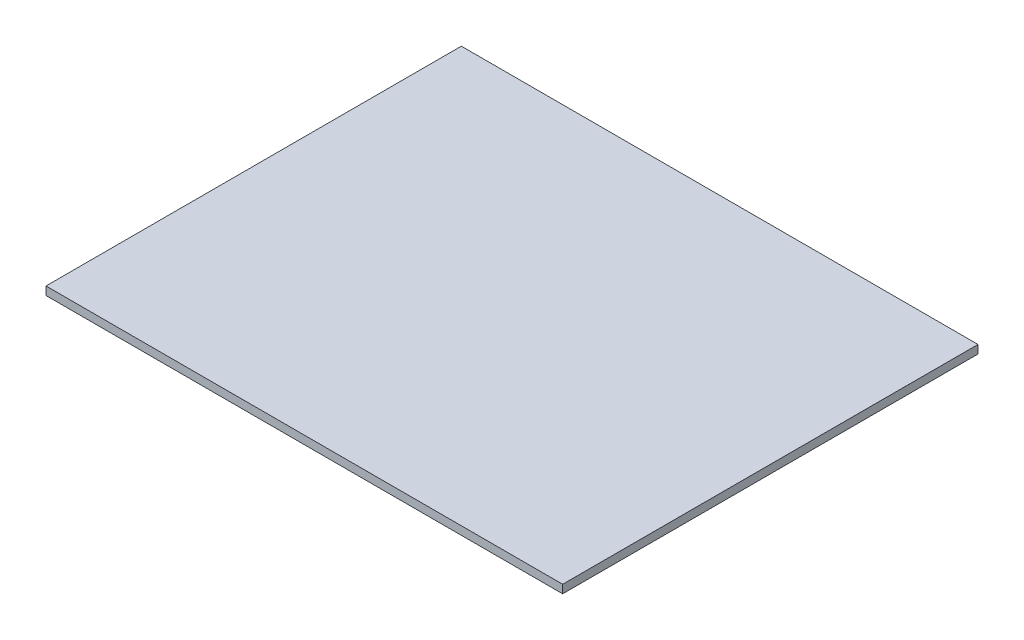
ISO-10303-21;
HEADER;
FILE_DESCRIPTION(('STEP AP214'),'2;1');
FILE_NAME('part.step','',(''),(''),'','','');
FILE_SCHEMA(('AUTOMOTIVE_DESIGN { 1 0 10303 214 1 1 1 1 }'));
ENDSEC;
DATA;
#1=APPLICATION_CONTEXT('core data for automotive mechanical design processes');
#2=APPLICATION_PROTOCOL_DEFINITION('international standard','automotive_design',2000,#1);
#3=PRODUCT_CONTEXT('',#1,'mechanical');
#4=PRODUCT('Part','Part','',(#3));
#5=PRODUCT_RELATED_PRODUCT_CATEGORY('part','',(#4));
#6=PRODUCT_DEFINITION_FORMATION('','',#4);
#7=PRODUCT_DEFINITION_CONTEXT('part definition',#1,'design');
#8=PRODUCT_DEFINITION('design','',#6,#7);
#9=PRODUCT_DEFINITION_SHAPE('','',#8);
#10=(LENGTH_UNIT() NAMED_UNIT(*) SI_UNIT(.MILLI.,.METRE.));
#11=(NAMED_UNIT(*) PLANE_ANGLE_UNIT() SI_UNIT($,.RADIAN.));
#12=(NAMED_UNIT(*) SI_UNIT($,.STERADIAN.) SOLID_ANGLE_UNIT());
#13=UNCERTAINTY_MEASURE_WITH_UNIT(LENGTH_MEASURE(1.E-05),#10,'distance_accuracy_value','');
#14=(GEOMETRIC_REPRESENTATION_CONTEXT(3) GLOBAL_UNCERTAINTY_ASSIGNED_CONTEXT((#13)) GLOBAL_UNIT_ASSIGNED_CONTEXT((#10,
#11,#12)) REPRESENTATION_CONTEXT('',''));
#15=CARTESIAN_POINT('',(0.,0.,0.));
#16=DIRECTION('',(0.,0.,1.));
#17=DIRECTION('',(1.,0.,0.));
#18=AXIS2_PLACEMENT_3D('',#15,#16,#17);
#19=CARTESIAN_POINT('',(355.787500000039,247.8,14.224));
#20=DIRECTION('',(-1.,0.,0.));
#21=DIRECTION('',(0.,0.,1.));
#22=AXIS2_PLACEMENT_3D('',#19,#20,#21);
#23=PLANE('',#22);
#24=DIRECTION('',(0.,0.,-1.));
#25=VECTOR('',#24,1.);
#26=CARTESIAN_POINT('',(355.787500000039,241.45,14.224));
#27=LINE('',#26,#25);
#28=CARTESIAN_POINT('',(355.787500000039,241.45,14.224));
#29=VERTEX_POINT('',#28);
#30=CARTESIAN_POINT('',(355.787500000039,241.45,-303.699000032));
#31=VERTEX_POINT('',#30);
#32=EDGE_CURVE('E96',#29,#31,#27,.T.);
#33=ORIENTED_EDGE('',*,*,#32,.T.);
#34=DIRECTION('',(0.,-1.,0.));
#35=VECTOR('',#34,1.);
#36=CARTESIAN_POINT('',(355.787500000039,247.8,-303.699000032));
#37=LINE('',#36,#35);
#38=CARTESIAN_POINT('',(355.787500000039,247.8,-303.699000032));
#39=VERTEX_POINT('',#38);
#40=EDGE_CURVE('E11',#39,#31,#37,.T.);
#41=ORIENTED_EDGE('',*,*,#40,.F.);
#42=DIRECTION('',(0.,0.,-1.));
#43=VECTOR('',#42,1.);
#44=CARTESIAN_POINT('',(355.787500000039,247.8,14.224));
#45=LINE('',#44,#43);
#46=CARTESIAN_POINT('',(355.787500000039,247.8,14.224));
#47=VERTEX_POINT('',#46);
#48=EDGE_CURVE('E84',#47,#39,#45,.T.);
#49=ORIENTED_EDGE('',*,*,#48,.F.);
#50=DIRECTION('',(0.,-1.,0.));
#51=VECTOR('',#50,1.);
#52=CARTESIAN_POINT('',(355.787500000039,247.8,14.224));
#53=LINE('',#52,#51);
#54=EDGE_CURVE('E92',#47,#29,#53,.T.);
#55=ORIENTED_EDGE('',*,*,#54,.T.);
#56=EDGE_LOOP('',(#33,#41,#49,#55));
#57=FACE_BOUND('',#56,.T.);
#58=ADVANCED_FACE('F33',(#57),#23,.F.);
#59=CARTESIAN_POINT('',(355.787500000039,247.8,-303.699000032));
#60=DIRECTION('',(0.,0.,1.));
#61=DIRECTION('',(1.,0.,0.));
#62=AXIS2_PLACEMENT_3D('',#59,#60,#61);
#63=PLANE('',#62);
#64=DIRECTION('',(-1.,0.,0.));
#65=VECTOR('',#64,1.);
#66=CARTESIAN_POINT('',(355.787500000039,241.45,-303.699000032));
#67=LINE('',#66,#65);
#68=CARTESIAN_POINT('',(-39.6875,241.45,-303.699000032));
#69=VERTEX_POINT('',#68);
#70=EDGE_CURVE('E88',#31,#69,#67,.T.);
#71=ORIENTED_EDGE('',*,*,#70,.T.);
#72=DIRECTION('',(0.,-1.,0.));
#73=VECTOR('',#72,1.);
#74=CARTESIAN_POINT('',(-39.6875,247.8,-303.699000032));
#75=LINE('',#74,#73);
#76=CARTESIAN_POINT('',(-39.6875,247.8,-303.699000032));
#77=VERTEX_POINT('',#76);
#78=EDGE_CURVE('E41',#77,#69,#75,.T.);
#79=ORIENTED_EDGE('',*,*,#78,.F.);
#80=DIRECTION('',(-1.,0.,0.));
#81=VECTOR('',#80,1.);
#82=CARTESIAN_POINT('',(355.787500000039,247.8,-303.699000032));
#83=LINE('',#82,#81);
#84=EDGE_CURVE('E79',#39,#77,#83,.T.);
#85=ORIENTED_EDGE('',*,*,#84,.F.);
#86=ORIENTED_EDGE('',*,*,#40,.T.);
#87=EDGE_LOOP('',(#71,#79,#85,#86));
#88=FACE_BOUND('',#87,.T.);
#89=ADVANCED_FACE('F87',(#88),#63,.F.);
#90=CARTESIAN_POINT('',(-39.6875,247.8,14.2240000000001));
#91=DIRECTION('',(1.,0.,0.));
#92=DIRECTION('',(0.,0.,-1.));
#93=AXIS2_PLACEMENT_3D('',#90,#91,#92);
#94=PLANE('',#93);
#95=DIRECTION('',(0.,0.,1.));
#96=VECTOR('',#95,1.);
#97=CARTESIAN_POINT('',(-39.6875,241.45,14.2240000000001));
#98=LINE('',#97,#96);
#99=CARTESIAN_POINT('',(-39.6875,241.45,14.2240000000001));
#100=VERTEX_POINT('',#99);
#101=EDGE_CURVE('E66',#69,#100,#98,.T.);
#102=ORIENTED_EDGE('',*,*,#101,.T.);
#103=DIRECTION('',(0.,-1.,0.));
#104=VECTOR('',#103,1.);
#105=CARTESIAN_POINT('',(-39.6875,247.8,14.2240000000001));
#106=LINE('',#105,#104);
#107=CARTESIAN_POINT('',(-39.6875,247.8,14.2240000000001));
#108=VERTEX_POINT('',#107);
#109=EDGE_CURVE('E89',#108,#100,#106,.T.);
#110=ORIENTED_EDGE('',*,*,#109,.F.);
#111=DIRECTION('',(0.,0.,1.));
#112=VECTOR('',#111,1.);
#113=CARTESIAN_POINT('',(-39.6875,247.8,14.2240000000001));
#114=LINE('',#113,#112);
#115=EDGE_CURVE('E82',#77,#108,#114,.T.);
#116=ORIENTED_EDGE('',*,*,#115,.F.);
#117=ORIENTED_EDGE('',*,*,#78,.T.);
#118=EDGE_LOOP('',(#102,#110,#116,#117));
#119=FACE_BOUND('',#118,.T.);
#120=ADVANCED_FACE('F90',(#119),#94,.F.);
#121=CARTESIAN_POINT('',(355.787500000039,247.8,14.224));
#122=DIRECTION('',(0.,0.,-1.));
#123=DIRECTION('',(-1.,0.,0.));
#124=AXIS2_PLACEMENT_3D('',#121,#122,#123);
#125=PLANE('',#124);
#126=DIRECTION('',(1.,0.,0.));
#127=VECTOR('',#126,1.);
#128=CARTESIAN_POINT('',(355.787500000039,241.45,14.224));
#129=LINE('',#128,#127);
#130=EDGE_CURVE('E72',#100,#29,#129,.T.);
#131=ORIENTED_EDGE('',*,*,#130,.T.);
#132=ORIENTED_EDGE('',*,*,#54,.F.);
#133=DIRECTION('',(1.,0.,0.));
#134=VECTOR('',#133,1.);
#135=CARTESIAN_POINT('',(355.787500000039,247.8,14.224));
#136=LINE('',#135,#134);
#137=EDGE_CURVE('E49',#108,#47,#136,.T.);
#138=ORIENTED_EDGE('',*,*,#137,.F.);
#139=ORIENTED_EDGE('',*,*,#109,.T.);
#140=EDGE_LOOP('',(#131,#132,#138,#139));
#141=FACE_BOUND('',#140,.T.);
#142=ADVANCED_FACE('F103',(#141),#125,.F.);
#143=CARTESIAN_POINT('',(0.,247.8,0.));
#144=DIRECTION('',(0.,1.,0.));
#145=DIRECTION('',(0.,0.,1.));
#146=AXIS2_PLACEMENT_3D('',#143,#144,#145);
#147=PLANE('',#146);
#148=ORIENTED_EDGE('',*,*,#48,.T.);
#149=ORIENTED_EDGE('',*,*,#84,.T.);
#150=ORIENTED_EDGE('',*,*,#115,.T.);
#151=ORIENTED_EDGE('',*,*,#137,.T.);
#152=EDGE_LOOP('',(#148,#149,#150,#151));
#153=FACE_BOUND('',#152,.T.);
#154=ADVANCED_FACE('F80',(#153),#147,.T.);
#155=CARTESIAN_POINT('',(0.,241.45,0.));
#156=DIRECTION('',(0.,1.,0.));
#157=DIRECTION('',(0.,0.,1.));
#158=AXIS2_PLACEMENT_3D('',#155,#156,#157);
#159=PLANE('',#158);
#160=ORIENTED_EDGE('',*,*,#32,.F.);
#161=ORIENTED_EDGE('',*,*,#130,.F.);
#162=ORIENTED_EDGE('',*,*,#101,.F.);
#163=ORIENTED_EDGE('',*,*,#70,.F.);
#164=EDGE_LOOP('',(#160,#161,#162,#163));
#165=FACE_BOUND('',#164,.T.);
#166=ADVANCED_FACE('F106',(#165),#159,.F.);
#167=CLOSED_SHELL('',(#58,#89,#120,#142,#154,#166));
#168=MANIFOLD_SOLID_BREP('B2',#167);
#169=ADVANCED_BREP_SHAPE_REPRESENTATION('',(#18,#168),#14);
#170=SHAPE_DEFINITION_REPRESENTATION(#9,#169);
ENDSEC;
END-ISO-10303-21;
